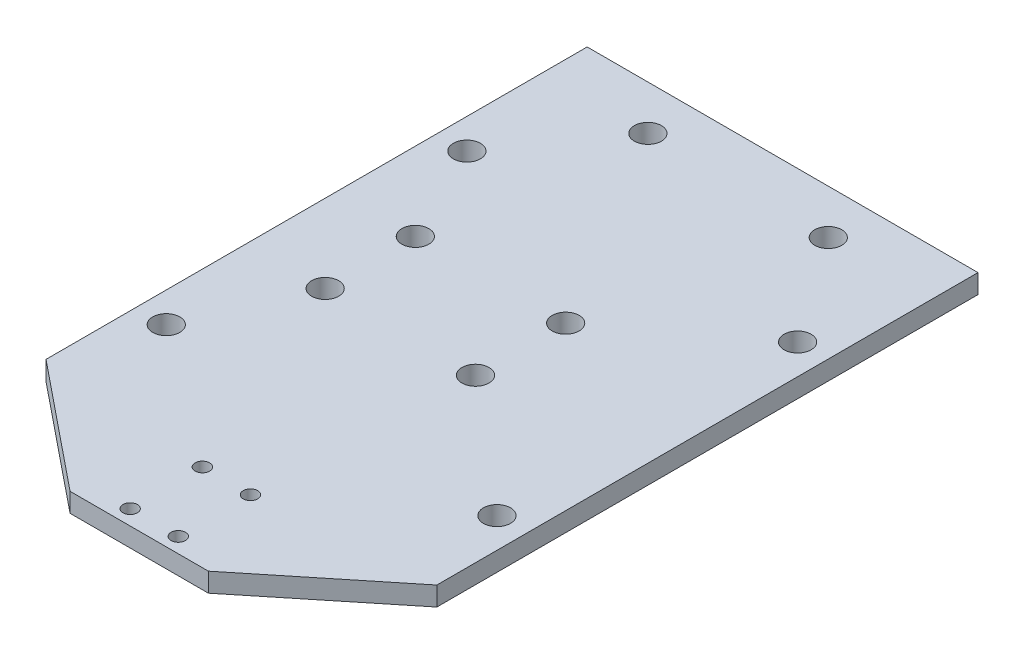
ISO-10303-21;
HEADER;
FILE_DESCRIPTION(('STEP AP214'),'2;1');
FILE_NAME('part.step','',(''),(''),'','','');
FILE_SCHEMA(('AUTOMOTIVE_DESIGN { 1 0 10303 214 1 1 1 1 }'));
ENDSEC;
DATA;
#1=APPLICATION_CONTEXT('core data for automotive mechanical design processes');
#2=APPLICATION_PROTOCOL_DEFINITION('international standard','automotive_design',2000,#1);
#3=PRODUCT_CONTEXT('',#1,'mechanical');
#4=PRODUCT('Part','Part','',(#3));
#5=PRODUCT_RELATED_PRODUCT_CATEGORY('part','',(#4));
#6=PRODUCT_DEFINITION_FORMATION('','',#4);
#7=PRODUCT_DEFINITION_CONTEXT('part definition',#1,'design');
#8=PRODUCT_DEFINITION('design','',#6,#7);
#9=PRODUCT_DEFINITION_SHAPE('','',#8);
#10=(LENGTH_UNIT() NAMED_UNIT(*) SI_UNIT(.MILLI.,.METRE.));
#11=(NAMED_UNIT(*) PLANE_ANGLE_UNIT() SI_UNIT($,.RADIAN.));
#12=(NAMED_UNIT(*) SI_UNIT($,.STERADIAN.) SOLID_ANGLE_UNIT());
#13=UNCERTAINTY_MEASURE_WITH_UNIT(LENGTH_MEASURE(1.E-05),#10,'distance_accuracy_value','');
#14=(GEOMETRIC_REPRESENTATION_CONTEXT(3) GLOBAL_UNCERTAINTY_ASSIGNED_CONTEXT((#13)) GLOBAL_UNIT_ASSIGNED_CONTEXT((#10,
#11,#12)) REPRESENTATION_CONTEXT('',''));
#15=CARTESIAN_POINT('',(0.,0.,0.));
#16=DIRECTION('',(0.,0.,1.));
#17=DIRECTION('',(1.,0.,0.));
#18=AXIS2_PLACEMENT_3D('',#15,#16,#17);
#19=CARTESIAN_POINT('',(0.,1.5875,62.));
#20=DIRECTION('',(0.,0.,-1.));
#21=DIRECTION('',(-1.,0.,0.));
#22=AXIS2_PLACEMENT_3D('',#19,#20,#21);
#23=PLANE('',#22);
#24=DIRECTION('',(1.,0.,0.));
#25=VECTOR('',#24,1.);
#26=CARTESIAN_POINT('',(0.,-1.5875,62.));
#27=LINE('',#26,#25);
#28=CARTESIAN_POINT('',(-11.5,-1.5875,62.));
#29=VERTEX_POINT('',#28);
#30=CARTESIAN_POINT('',(11.5,-1.5875,62.));
#31=VERTEX_POINT('',#30);
#32=EDGE_CURVE('E128',#29,#31,#27,.T.);
#33=ORIENTED_EDGE('',*,*,#32,.T.);
#34=DIRECTION('',(0.,-1.,0.));
#35=VECTOR('',#34,1.);
#36=CARTESIAN_POINT('',(11.5,1.5875,62.));
#37=LINE('',#36,#35);
#38=CARTESIAN_POINT('',(11.5,1.5875,62.));
#39=VERTEX_POINT('',#38);
#40=EDGE_CURVE('E11',#39,#31,#37,.T.);
#41=ORIENTED_EDGE('',*,*,#40,.F.);
#42=DIRECTION('',(1.,0.,0.));
#43=VECTOR('',#42,1.);
#44=CARTESIAN_POINT('',(0.,1.5875,62.));
#45=LINE('',#44,#43);
#46=CARTESIAN_POINT('',(-11.5,1.5875,62.));
#47=VERTEX_POINT('',#46);
#48=EDGE_CURVE('E141',#47,#39,#45,.T.);
#49=ORIENTED_EDGE('',*,*,#48,.F.);
#50=DIRECTION('',(0.,-1.,0.));
#51=VECTOR('',#50,1.);
#52=CARTESIAN_POINT('',(-11.5,1.5875,62.));
#53=LINE('',#52,#51);
#54=EDGE_CURVE('E59',#47,#29,#53,.T.);
#55=ORIENTED_EDGE('',*,*,#54,.T.);
#56=EDGE_LOOP('',(#33,#41,#49,#55));
#57=FACE_BOUND('',#56,.T.);
#58=ADVANCED_FACE('F43',(#57),#23,.F.);
#59=CARTESIAN_POINT('',(34.8732876712329,1.5875,43.0787671232877));
#60=DIRECTION('',(-0.629198228667964,0.,-0.777244870707486));
#61=DIRECTION('',(-0.777244870707486,0.,0.629198228667964));
#62=AXIS2_PLACEMENT_3D('',#59,#60,#61);
#63=PLANE('',#62);
#64=DIRECTION('',(0.777244870707486,0.,-0.629198228667964));
#65=VECTOR('',#64,1.);
#66=CARTESIAN_POINT('',(34.8732876712329,-1.5875,43.0787671232877));
#67=LINE('',#66,#65);
#68=CARTESIAN_POINT('',(32.5,-1.5875,45.));
#69=VERTEX_POINT('',#68);
#70=EDGE_CURVE('E130',#31,#69,#67,.T.);
#71=ORIENTED_EDGE('',*,*,#70,.T.);
#72=DIRECTION('',(0.,-1.,0.));
#73=VECTOR('',#72,1.);
#74=CARTESIAN_POINT('',(32.5,1.5875,45.));
#75=LINE('',#74,#73);
#76=CARTESIAN_POINT('',(32.5,1.5875,45.));
#77=VERTEX_POINT('',#76);
#78=EDGE_CURVE('E51',#77,#69,#75,.T.);
#79=ORIENTED_EDGE('',*,*,#78,.F.);
#80=DIRECTION('',(0.777244870707486,0.,-0.629198228667964));
#81=VECTOR('',#80,1.);
#82=CARTESIAN_POINT('',(34.8732876712329,1.5875,43.0787671232877));
#83=LINE('',#82,#81);
#84=EDGE_CURVE('E91',#39,#77,#83,.T.);
#85=ORIENTED_EDGE('',*,*,#84,.F.);
#86=ORIENTED_EDGE('',*,*,#40,.T.);
#87=EDGE_LOOP('',(#71,#79,#85,#86));
#88=FACE_BOUND('',#87,.T.);
#89=ADVANCED_FACE('F163',(#88),#63,.F.);
#90=CARTESIAN_POINT('',(32.5,1.5875,0.));
#91=DIRECTION('',(-1.,0.,0.));
#92=DIRECTION('',(0.,0.,1.));
#93=AXIS2_PLACEMENT_3D('',#90,#91,#92);
#94=PLANE('',#93);
#95=DIRECTION('',(0.,0.,-1.));
#96=VECTOR('',#95,1.);
#97=CARTESIAN_POINT('',(32.5,-1.5875,0.));
#98=LINE('',#97,#96);
#99=CARTESIAN_POINT('',(32.5,-1.5875,-45.));
#100=VERTEX_POINT('',#99);
#101=EDGE_CURVE('E133',#69,#100,#98,.T.);
#102=ORIENTED_EDGE('',*,*,#101,.T.);
#103=DIRECTION('',(0.,-1.,0.));
#104=VECTOR('',#103,1.);
#105=CARTESIAN_POINT('',(32.5,1.5875,-45.));
#106=LINE('',#105,#104);
#107=CARTESIAN_POINT('',(32.5,1.5875,-45.));
#108=VERTEX_POINT('',#107);
#109=EDGE_CURVE('E120',#108,#100,#106,.T.);
#110=ORIENTED_EDGE('',*,*,#109,.F.);
#111=DIRECTION('',(0.,0.,-1.));
#112=VECTOR('',#111,1.);
#113=CARTESIAN_POINT('',(32.5,1.5875,0.));
#114=LINE('',#113,#112);
#115=EDGE_CURVE('E108',#77,#108,#114,.T.);
#116=ORIENTED_EDGE('',*,*,#115,.F.);
#117=ORIENTED_EDGE('',*,*,#78,.T.);
#118=EDGE_LOOP('',(#102,#110,#116,#117));
#119=FACE_BOUND('',#118,.T.);
#120=ADVANCED_FACE('F147',(#119),#94,.F.);
#121=CARTESIAN_POINT('',(0.,1.5875,-45.));
#122=DIRECTION('',(0.,0.,1.));
#123=DIRECTION('',(1.,0.,0.));
#124=AXIS2_PLACEMENT_3D('',#121,#122,#123);
#125=PLANE('',#124);
#126=DIRECTION('',(-1.,0.,0.));
#127=VECTOR('',#126,1.);
#128=CARTESIAN_POINT('',(0.,-1.5875,-45.));
#129=LINE('',#128,#127);
#130=CARTESIAN_POINT('',(-32.5,-1.5875,-45.));
#131=VERTEX_POINT('',#130);
#132=EDGE_CURVE('E117',#100,#131,#129,.T.);
#133=ORIENTED_EDGE('',*,*,#132,.T.);
#134=DIRECTION('',(0.,-1.,0.));
#135=VECTOR('',#134,1.);
#136=CARTESIAN_POINT('',(-32.5,1.5875,-45.));
#137=LINE('',#136,#135);
#138=CARTESIAN_POINT('',(-32.5,1.5875,-45.));
#139=VERTEX_POINT('',#138);
#140=EDGE_CURVE('E114',#139,#131,#137,.T.);
#141=ORIENTED_EDGE('',*,*,#140,.F.);
#142=DIRECTION('',(-1.,0.,0.));
#143=VECTOR('',#142,1.);
#144=CARTESIAN_POINT('',(0.,1.5875,-45.));
#145=LINE('',#144,#143);
#146=EDGE_CURVE('E101',#108,#139,#145,.T.);
#147=ORIENTED_EDGE('',*,*,#146,.F.);
#148=ORIENTED_EDGE('',*,*,#109,.T.);
#149=EDGE_LOOP('',(#133,#141,#147,#148));
#150=FACE_BOUND('',#149,.T.);
#151=ADVANCED_FACE('F115',(#150),#125,.F.);
#152=CARTESIAN_POINT('',(-32.5,1.5875,0.));
#153=DIRECTION('',(-1.,0.,0.));
#154=DIRECTION('',(0.,0.,1.));
#155=AXIS2_PLACEMENT_3D('',#152,#153,#154);
#156=PLANE('',#155);
#157=DIRECTION('',(0.,0.,-1.));
#158=VECTOR('',#157,1.);
#159=CARTESIAN_POINT('',(-32.5,-1.5875,0.));
#160=LINE('',#159,#158);
#161=CARTESIAN_POINT('',(-32.5,-1.5875,45.));
#162=VERTEX_POINT('',#161);
#163=EDGE_CURVE('E136',#162,#131,#160,.T.);
#164=ORIENTED_EDGE('',*,*,#163,.F.);
#165=DIRECTION('',(0.,-1.,0.));
#166=VECTOR('',#165,1.);
#167=CARTESIAN_POINT('',(-32.5,1.5875,45.));
#168=LINE('',#167,#166);
#169=CARTESIAN_POINT('',(-32.5,1.5875,45.));
#170=VERTEX_POINT('',#169);
#171=EDGE_CURVE('E79',#170,#162,#168,.T.);
#172=ORIENTED_EDGE('',*,*,#171,.F.);
#173=DIRECTION('',(0.,0.,-1.));
#174=VECTOR('',#173,1.);
#175=CARTESIAN_POINT('',(-32.5,1.5875,0.));
#176=LINE('',#175,#174);
#177=EDGE_CURVE('E106',#170,#139,#176,.T.);
#178=ORIENTED_EDGE('',*,*,#177,.T.);
#179=ORIENTED_EDGE('',*,*,#140,.T.);
#180=EDGE_LOOP('',(#164,#172,#178,#179));
#181=FACE_BOUND('',#180,.T.);
#182=ADVANCED_FACE('F122',(#181),#156,.T.);
#183=CARTESIAN_POINT('',(-34.8732876712329,1.5875,43.0787671232876));
#184=DIRECTION('',(-0.629198228667965,0.,0.777244870707485));
#185=DIRECTION('',(0.777244870707485,0.,0.629198228667965));
#186=AXIS2_PLACEMENT_3D('',#183,#184,#185);
#187=PLANE('',#186);
#188=DIRECTION('',(-0.777244870707485,0.,-0.629198228667965));
#189=VECTOR('',#188,1.);
#190=CARTESIAN_POINT('',(-34.8732876712329,-1.5875,43.0787671232876));
#191=LINE('',#190,#189);
#192=EDGE_CURVE('E138',#29,#162,#191,.T.);
#193=ORIENTED_EDGE('',*,*,#192,.F.);
#194=ORIENTED_EDGE('',*,*,#54,.F.);
#195=DIRECTION('',(-0.777244870707485,0.,-0.629198228667965));
#196=VECTOR('',#195,1.);
#197=CARTESIAN_POINT('',(-34.8732876712329,1.5875,43.0787671232876));
#198=LINE('',#197,#196);
#199=EDGE_CURVE('E123',#47,#170,#198,.T.);
#200=ORIENTED_EDGE('',*,*,#199,.T.);
#201=ORIENTED_EDGE('',*,*,#171,.T.);
#202=EDGE_LOOP('',(#193,#194,#200,#201));
#203=FACE_BOUND('',#202,.T.);
#204=ADVANCED_FACE('F150',(#203),#187,.T.);
#205=CARTESIAN_POINT('',(0.,1.5875,0.));
#206=DIRECTION('',(0.,1.,0.));
#207=DIRECTION('',(0.,0.,1.));
#208=AXIS2_PLACEMENT_3D('',#205,#206,#207);
#209=PLANE('',#208);
#210=CARTESIAN_POINT('',(15.,1.5875,-37.6));
#211=DIRECTION('',(0.,-1.,0.));
#212=DIRECTION('',(0.,0.,-1.));
#213=AXIS2_PLACEMENT_3D('',#210,#211,#212);
#214=CIRCLE('',#213,2.25);
#215=CARTESIAN_POINT('',(15.,1.5875,-39.85));
#216=VERTEX_POINT('',#215);
#217=EDGE_CURVE('E248',#216,#216,#214,.T.);
#218=ORIENTED_EDGE('',*,*,#217,.T.);
#219=EDGE_LOOP('',(#218));
#220=FACE_BOUND('',#219,.T.);
#221=CARTESIAN_POINT('',(-15.,1.5875,-37.6));
#222=DIRECTION('',(0.,-1.,0.));
#223=DIRECTION('',(0.,0.,-1.));
#224=AXIS2_PLACEMENT_3D('',#221,#222,#223);
#225=CIRCLE('',#224,2.25);
#226=CARTESIAN_POINT('',(-15.,1.5875,-39.85));
#227=VERTEX_POINT('',#226);
#228=EDGE_CURVE('E242',#227,#227,#225,.T.);
#229=ORIENTED_EDGE('',*,*,#228,.T.);
#230=EDGE_LOOP('',(#229));
#231=FACE_BOUND('',#230,.T.);
#232=CARTESIAN_POINT('',(-19.5,1.5875,11.575));
#233=DIRECTION('',(0.,1.,0.));
#234=DIRECTION('',(0.,0.,1.));
#235=AXIS2_PLACEMENT_3D('',#232,#233,#234);
#236=CIRCLE('',#235,2.24999999999999);
#237=CARTESIAN_POINT('',(-19.5,1.5875,13.825));
#238=VERTEX_POINT('',#237);
#239=EDGE_CURVE('E239',#238,#238,#236,.T.);
#240=ORIENTED_EDGE('',*,*,#239,.F.);
#241=EDGE_LOOP('',(#240));
#242=FACE_BOUND('',#241,.T.);
#243=CARTESIAN_POINT('',(-19.5,1.5875,-3.42499999999997));
#244=DIRECTION('',(0.,1.,0.));
#245=DIRECTION('',(0.,0.,1.));
#246=AXIS2_PLACEMENT_3D('',#243,#244,#245);
#247=CIRCLE('',#246,2.24999999999999);
#248=CARTESIAN_POINT('',(-19.5,1.5875,-1.17499999999998));
#249=VERTEX_POINT('',#248);
#250=EDGE_CURVE('E233',#249,#249,#247,.T.);
#251=ORIENTED_EDGE('',*,*,#250,.F.);
#252=EDGE_LOOP('',(#251));
#253=FACE_BOUND('',#252,.T.);
#254=CARTESIAN_POINT('',(5.5,1.5875,-3.42499999999997));
#255=DIRECTION('',(0.,1.,0.));
#256=DIRECTION('',(0.,0.,1.));
#257=AXIS2_PLACEMENT_3D('',#254,#255,#256);
#258=CIRCLE('',#257,2.24999999999999);
#259=CARTESIAN_POINT('',(5.5,1.5875,-1.17499999999998));
#260=VERTEX_POINT('',#259);
#261=EDGE_CURVE('E227',#260,#260,#258,.T.);
#262=ORIENTED_EDGE('',*,*,#261,.F.);
#263=EDGE_LOOP('',(#262));
#264=FACE_BOUND('',#263,.T.);
#265=CARTESIAN_POINT('',(5.5,1.5875,11.575));
#266=DIRECTION('',(0.,1.,0.));
#267=DIRECTION('',(0.,0.,1.));
#268=AXIS2_PLACEMENT_3D('',#265,#266,#267);
#269=CIRCLE('',#268,2.24999999999999);
#270=CARTESIAN_POINT('',(5.5,1.5875,13.825));
#271=VERTEX_POINT('',#270);
#272=EDGE_CURVE('E221',#271,#271,#269,.T.);
#273=ORIENTED_EDGE('',*,*,#272,.F.);
#274=EDGE_LOOP('',(#273));
#275=FACE_BOUND('',#274,.T.);
#276=CARTESIAN_POINT('',(-27.5,1.5875,-20.));
#277=DIRECTION('',(0.,1.,0.));
#278=DIRECTION('',(0.,0.,1.));
#279=AXIS2_PLACEMENT_3D('',#276,#277,#278);
#280=CIRCLE('',#279,2.24999999999999);
#281=CARTESIAN_POINT('',(-27.5,1.5875,-17.75));
#282=VERTEX_POINT('',#281);
#283=EDGE_CURVE('E215',#282,#282,#280,.T.);
#284=ORIENTED_EDGE('',*,*,#283,.F.);
#285=EDGE_LOOP('',(#284));
#286=FACE_BOUND('',#285,.T.);
#287=CARTESIAN_POINT('',(27.5,1.5875,-20.));
#288=DIRECTION('',(0.,1.,0.));
#289=DIRECTION('',(0.,0.,1.));
#290=AXIS2_PLACEMENT_3D('',#287,#288,#289);
#291=CIRCLE('',#290,2.24999999999999);
#292=CARTESIAN_POINT('',(27.5,1.5875,-17.75));
#293=VERTEX_POINT('',#292);
#294=EDGE_CURVE('E209',#293,#293,#291,.T.);
#295=ORIENTED_EDGE('',*,*,#294,.F.);
#296=EDGE_LOOP('',(#295));
#297=FACE_BOUND('',#296,.T.);
#298=CARTESIAN_POINT('',(27.5,1.5875,30.));
#299=DIRECTION('',(0.,1.,0.));
#300=DIRECTION('',(0.,0.,1.));
#301=AXIS2_PLACEMENT_3D('',#298,#299,#300);
#302=CIRCLE('',#301,2.24999999999999);
#303=CARTESIAN_POINT('',(27.5,1.5875,32.25));
#304=VERTEX_POINT('',#303);
#305=EDGE_CURVE('E203',#304,#304,#302,.T.);
#306=ORIENTED_EDGE('',*,*,#305,.F.);
#307=EDGE_LOOP('',(#306));
#308=FACE_BOUND('',#307,.T.);
#309=CARTESIAN_POINT('',(-27.5,1.5875,30.));
#310=DIRECTION('',(0.,1.,0.));
#311=DIRECTION('',(0.,0.,1.));
#312=AXIS2_PLACEMENT_3D('',#309,#310,#311);
#313=CIRCLE('',#312,2.24999999999999);
#314=CARTESIAN_POINT('',(-27.5,1.5875,32.25));
#315=VERTEX_POINT('',#314);
#316=EDGE_CURVE('E197',#315,#315,#313,.T.);
#317=ORIENTED_EDGE('',*,*,#316,.F.);
#318=EDGE_LOOP('',(#317));
#319=FACE_BOUND('',#318,.T.);
#320=CARTESIAN_POINT('',(-4.,1.5875,59.5));
#321=DIRECTION('',(0.,1.,0.));
#322=DIRECTION('',(0.,0.,1.));
#323=AXIS2_PLACEMENT_3D('',#320,#321,#322);
#324=CIRCLE('',#323,1.2);
#325=CARTESIAN_POINT('',(-4.,1.5875,60.7));
#326=VERTEX_POINT('',#325);
#327=EDGE_CURVE('E191',#326,#326,#324,.T.);
#328=ORIENTED_EDGE('',*,*,#327,.F.);
#329=EDGE_LOOP('',(#328));
#330=FACE_BOUND('',#329,.T.);
#331=CARTESIAN_POINT('',(4.,1.5875,59.5));
#332=DIRECTION('',(0.,1.,0.));
#333=DIRECTION('',(0.,0.,1.));
#334=AXIS2_PLACEMENT_3D('',#331,#332,#333);
#335=CIRCLE('',#334,1.2);
#336=CARTESIAN_POINT('',(4.,1.5875,60.7));
#337=VERTEX_POINT('',#336);
#338=EDGE_CURVE('E185',#337,#337,#335,.T.);
#339=ORIENTED_EDGE('',*,*,#338,.F.);
#340=EDGE_LOOP('',(#339));
#341=FACE_BOUND('',#340,.T.);
#342=CARTESIAN_POINT('',(4.,1.5875,47.5));
#343=DIRECTION('',(0.,1.,0.));
#344=DIRECTION('',(0.,0.,1.));
#345=AXIS2_PLACEMENT_3D('',#342,#343,#344);
#346=CIRCLE('',#345,1.2);
#347=CARTESIAN_POINT('',(4.,1.5875,48.7));
#348=VERTEX_POINT('',#347);
#349=EDGE_CURVE('E179',#348,#348,#346,.T.);
#350=ORIENTED_EDGE('',*,*,#349,.F.);
#351=EDGE_LOOP('',(#350));
#352=FACE_BOUND('',#351,.T.);
#353=CARTESIAN_POINT('',(-4.,1.5875,47.5));
#354=DIRECTION('',(0.,1.,0.));
#355=DIRECTION('',(0.,0.,1.));
#356=AXIS2_PLACEMENT_3D('',#353,#354,#355);
#357=CIRCLE('',#356,1.2);
#358=CARTESIAN_POINT('',(-4.,1.5875,48.7));
#359=VERTEX_POINT('',#358);
#360=EDGE_CURVE('E173',#359,#359,#357,.T.);
#361=ORIENTED_EDGE('',*,*,#360,.F.);
#362=EDGE_LOOP('',(#361));
#363=FACE_BOUND('',#362,.T.);
#364=ORIENTED_EDGE('',*,*,#48,.T.);
#365=ORIENTED_EDGE('',*,*,#84,.T.);
#366=ORIENTED_EDGE('',*,*,#115,.T.);
#367=ORIENTED_EDGE('',*,*,#146,.T.);
#368=ORIENTED_EDGE('',*,*,#177,.F.);
#369=ORIENTED_EDGE('',*,*,#199,.F.);
#370=EDGE_LOOP('',(#364,#365,#366,#367,#368,#369));
#371=FACE_BOUND('',#370,.T.);
#372=ADVANCED_FACE('F103',(#220,#231,#242,#253,#264,#275,#286,#297,#308,#319,#330,#341,#352,
#363,#371),#209,.T.);
#373=CARTESIAN_POINT('',(0.,-1.5875,0.));
#374=DIRECTION('',(0.,1.,0.));
#375=DIRECTION('',(0.,0.,1.));
#376=AXIS2_PLACEMENT_3D('',#373,#374,#375);
#377=PLANE('',#376);
#378=CARTESIAN_POINT('',(15.,-1.5875,-37.6));
#379=DIRECTION('',(0.,-1.,0.));
#380=DIRECTION('',(0.,0.,-1.));
#381=AXIS2_PLACEMENT_3D('',#378,#379,#380);
#382=CIRCLE('',#381,2.24999999999999);
#383=CARTESIAN_POINT('',(15.,-1.5875,-39.85));
#384=VERTEX_POINT('',#383);
#385=EDGE_CURVE('E251',#384,#384,#382,.T.);
#386=ORIENTED_EDGE('',*,*,#385,.F.);
#387=EDGE_LOOP('',(#386));
#388=FACE_BOUND('',#387,.T.);
#389=CARTESIAN_POINT('',(-15.,-1.5875,-37.6));
#390=DIRECTION('',(0.,-1.,0.));
#391=DIRECTION('',(0.,0.,-1.));
#392=AXIS2_PLACEMENT_3D('',#389,#390,#391);
#393=CIRCLE('',#392,2.24999999999999);
#394=CARTESIAN_POINT('',(-15.,-1.5875,-39.85));
#395=VERTEX_POINT('',#394);
#396=EDGE_CURVE('E245',#395,#395,#393,.T.);
#397=ORIENTED_EDGE('',*,*,#396,.F.);
#398=EDGE_LOOP('',(#397));
#399=FACE_BOUND('',#398,.T.);
#400=CARTESIAN_POINT('',(-19.5,-1.5875,11.575));
#401=DIRECTION('',(0.,1.,0.));
#402=DIRECTION('',(0.,0.,1.));
#403=AXIS2_PLACEMENT_3D('',#400,#401,#402);
#404=CIRCLE('',#403,2.24999999999999);
#405=CARTESIAN_POINT('',(-19.5,-1.5875,13.825));
#406=VERTEX_POINT('',#405);
#407=EDGE_CURVE('E236',#406,#406,#404,.T.);
#408=ORIENTED_EDGE('',*,*,#407,.T.);
#409=EDGE_LOOP('',(#408));
#410=FACE_BOUND('',#409,.T.);
#411=CARTESIAN_POINT('',(-19.5,-1.5875,-3.42499999999997));
#412=DIRECTION('',(0.,1.,0.));
#413=DIRECTION('',(0.,0.,1.));
#414=AXIS2_PLACEMENT_3D('',#411,#412,#413);
#415=CIRCLE('',#414,2.24999999999999);
#416=CARTESIAN_POINT('',(-19.5,-1.5875,-1.17499999999998));
#417=VERTEX_POINT('',#416);
#418=EDGE_CURVE('E230',#417,#417,#415,.T.);
#419=ORIENTED_EDGE('',*,*,#418,.T.);
#420=EDGE_LOOP('',(#419));
#421=FACE_BOUND('',#420,.T.);
#422=CARTESIAN_POINT('',(5.5,-1.5875,-3.42499999999997));
#423=DIRECTION('',(0.,1.,0.));
#424=DIRECTION('',(0.,0.,1.));
#425=AXIS2_PLACEMENT_3D('',#422,#423,#424);
#426=CIRCLE('',#425,2.24999999999999);
#427=CARTESIAN_POINT('',(5.5,-1.5875,-1.17499999999998));
#428=VERTEX_POINT('',#427);
#429=EDGE_CURVE('E224',#428,#428,#426,.T.);
#430=ORIENTED_EDGE('',*,*,#429,.T.);
#431=EDGE_LOOP('',(#430));
#432=FACE_BOUND('',#431,.T.);
#433=CARTESIAN_POINT('',(5.5,-1.5875,11.575));
#434=DIRECTION('',(0.,1.,0.));
#435=DIRECTION('',(0.,0.,1.));
#436=AXIS2_PLACEMENT_3D('',#433,#434,#435);
#437=CIRCLE('',#436,2.24999999999999);
#438=CARTESIAN_POINT('',(5.5,-1.5875,13.825));
#439=VERTEX_POINT('',#438);
#440=EDGE_CURVE('E218',#439,#439,#437,.T.);
#441=ORIENTED_EDGE('',*,*,#440,.T.);
#442=EDGE_LOOP('',(#441));
#443=FACE_BOUND('',#442,.T.);
#444=CARTESIAN_POINT('',(-27.5,-1.5875,-20.));
#445=DIRECTION('',(0.,1.,0.));
#446=DIRECTION('',(0.,0.,1.));
#447=AXIS2_PLACEMENT_3D('',#444,#445,#446);
#448=CIRCLE('',#447,2.25);
#449=CARTESIAN_POINT('',(-27.5,-1.5875,-17.75));
#450=VERTEX_POINT('',#449);
#451=EDGE_CURVE('E212',#450,#450,#448,.T.);
#452=ORIENTED_EDGE('',*,*,#451,.T.);
#453=EDGE_LOOP('',(#452));
#454=FACE_BOUND('',#453,.T.);
#455=CARTESIAN_POINT('',(27.5,-1.5875,-20.));
#456=DIRECTION('',(0.,1.,0.));
#457=DIRECTION('',(0.,0.,1.));
#458=AXIS2_PLACEMENT_3D('',#455,#456,#457);
#459=CIRCLE('',#458,2.25);
#460=CARTESIAN_POINT('',(27.5,-1.5875,-17.75));
#461=VERTEX_POINT('',#460);
#462=EDGE_CURVE('E206',#461,#461,#459,.T.);
#463=ORIENTED_EDGE('',*,*,#462,.T.);
#464=EDGE_LOOP('',(#463));
#465=FACE_BOUND('',#464,.T.);
#466=CARTESIAN_POINT('',(27.5,-1.5875,30.));
#467=DIRECTION('',(0.,1.,0.));
#468=DIRECTION('',(0.,0.,1.));
#469=AXIS2_PLACEMENT_3D('',#466,#467,#468);
#470=CIRCLE('',#469,2.25);
#471=CARTESIAN_POINT('',(27.5,-1.5875,32.25));
#472=VERTEX_POINT('',#471);
#473=EDGE_CURVE('E200',#472,#472,#470,.T.);
#474=ORIENTED_EDGE('',*,*,#473,.T.);
#475=EDGE_LOOP('',(#474));
#476=FACE_BOUND('',#475,.T.);
#477=CARTESIAN_POINT('',(-27.5,-1.5875,30.));
#478=DIRECTION('',(0.,1.,0.));
#479=DIRECTION('',(0.,0.,1.));
#480=AXIS2_PLACEMENT_3D('',#477,#478,#479);
#481=CIRCLE('',#480,2.25);
#482=CARTESIAN_POINT('',(-27.5,-1.5875,32.25));
#483=VERTEX_POINT('',#482);
#484=EDGE_CURVE('E194',#483,#483,#481,.T.);
#485=ORIENTED_EDGE('',*,*,#484,.T.);
#486=EDGE_LOOP('',(#485));
#487=FACE_BOUND('',#486,.T.);
#488=CARTESIAN_POINT('',(-4.,-1.5875,59.5));
#489=DIRECTION('',(0.,1.,0.));
#490=DIRECTION('',(0.,0.,1.));
#491=AXIS2_PLACEMENT_3D('',#488,#489,#490);
#492=CIRCLE('',#491,1.19999999999999);
#493=CARTESIAN_POINT('',(-4.,-1.5875,60.7));
#494=VERTEX_POINT('',#493);
#495=EDGE_CURVE('E188',#494,#494,#492,.T.);
#496=ORIENTED_EDGE('',*,*,#495,.T.);
#497=EDGE_LOOP('',(#496));
#498=FACE_BOUND('',#497,.T.);
#499=CARTESIAN_POINT('',(4.,-1.5875,59.5));
#500=DIRECTION('',(0.,1.,0.));
#501=DIRECTION('',(0.,0.,1.));
#502=AXIS2_PLACEMENT_3D('',#499,#500,#501);
#503=CIRCLE('',#502,1.19999999999999);
#504=CARTESIAN_POINT('',(4.,-1.5875,60.7));
#505=VERTEX_POINT('',#504);
#506=EDGE_CURVE('E182',#505,#505,#503,.T.);
#507=ORIENTED_EDGE('',*,*,#506,.T.);
#508=EDGE_LOOP('',(#507));
#509=FACE_BOUND('',#508,.T.);
#510=CARTESIAN_POINT('',(4.,-1.5875,47.5));
#511=DIRECTION('',(0.,1.,0.));
#512=DIRECTION('',(0.,0.,1.));
#513=AXIS2_PLACEMENT_3D('',#510,#511,#512);
#514=CIRCLE('',#513,1.19999999999999);
#515=CARTESIAN_POINT('',(4.,-1.5875,48.7));
#516=VERTEX_POINT('',#515);
#517=EDGE_CURVE('E176',#516,#516,#514,.T.);
#518=ORIENTED_EDGE('',*,*,#517,.T.);
#519=EDGE_LOOP('',(#518));
#520=FACE_BOUND('',#519,.T.);
#521=CARTESIAN_POINT('',(-4.,-1.5875,47.5));
#522=DIRECTION('',(0.,1.,0.));
#523=DIRECTION('',(0.,0.,1.));
#524=AXIS2_PLACEMENT_3D('',#521,#522,#523);
#525=CIRCLE('',#524,1.19999999999999);
#526=CARTESIAN_POINT('',(-4.,-1.5875,48.7));
#527=VERTEX_POINT('',#526);
#528=EDGE_CURVE('E131',#527,#527,#525,.T.);
#529=ORIENTED_EDGE('',*,*,#528,.T.);
#530=EDGE_LOOP('',(#529));
#531=FACE_BOUND('',#530,.T.);
#532=ORIENTED_EDGE('',*,*,#32,.F.);
#533=ORIENTED_EDGE('',*,*,#192,.T.);
#534=ORIENTED_EDGE('',*,*,#163,.T.);
#535=ORIENTED_EDGE('',*,*,#132,.F.);
#536=ORIENTED_EDGE('',*,*,#101,.F.);
#537=ORIENTED_EDGE('',*,*,#70,.F.);
#538=EDGE_LOOP('',(#532,#533,#534,#535,#536,#537));
#539=FACE_BOUND('',#538,.T.);
#540=ADVANCED_FACE('F149',(#388,#399,#410,#421,#432,#443,#454,#465,#476,#487,#498,#509,#520,
#531,#539),#377,.F.);
#541=CARTESIAN_POINT('',(-4.,1.5875,47.5));
#542=DIRECTION('',(0.,1.,0.));
#543=DIRECTION('',(0.,0.,1.));
#544=AXIS2_PLACEMENT_3D('',#541,#542,#543);
#545=CYLINDRICAL_SURFACE('',#544,1.19999999999999);
#546=ORIENTED_EDGE('',*,*,#528,.F.);
#547=EDGE_LOOP('',(#546));
#548=FACE_BOUND('',#547,.T.);
#549=ORIENTED_EDGE('',*,*,#360,.T.);
#550=EDGE_LOOP('',(#549));
#551=FACE_BOUND('',#550,.T.);
#552=ADVANCED_FACE('F259',(#548,#551),#545,.F.);
#553=CARTESIAN_POINT('',(4.,1.5875,47.5));
#554=DIRECTION('',(0.,1.,0.));
#555=DIRECTION('',(0.,0.,1.));
#556=AXIS2_PLACEMENT_3D('',#553,#554,#555);
#557=CYLINDRICAL_SURFACE('',#556,1.19999999999999);
#558=ORIENTED_EDGE('',*,*,#517,.F.);
#559=EDGE_LOOP('',(#558));
#560=FACE_BOUND('',#559,.T.);
#561=ORIENTED_EDGE('',*,*,#349,.T.);
#562=EDGE_LOOP('',(#561));
#563=FACE_BOUND('',#562,.T.);
#564=ADVANCED_FACE('F287',(#560,#563),#557,.F.);
#565=CARTESIAN_POINT('',(4.,1.5875,59.5));
#566=DIRECTION('',(0.,1.,0.));
#567=DIRECTION('',(0.,0.,1.));
#568=AXIS2_PLACEMENT_3D('',#565,#566,#567);
#569=CYLINDRICAL_SURFACE('',#568,1.19999999999999);
#570=ORIENTED_EDGE('',*,*,#506,.F.);
#571=EDGE_LOOP('',(#570));
#572=FACE_BOUND('',#571,.T.);
#573=ORIENTED_EDGE('',*,*,#338,.T.);
#574=EDGE_LOOP('',(#573));
#575=FACE_BOUND('',#574,.T.);
#576=ADVANCED_FACE('F294',(#572,#575),#569,.F.);
#577=CARTESIAN_POINT('',(-4.,1.5875,59.5));
#578=DIRECTION('',(0.,1.,0.));
#579=DIRECTION('',(0.,0.,1.));
#580=AXIS2_PLACEMENT_3D('',#577,#578,#579);
#581=CYLINDRICAL_SURFACE('',#580,1.19999999999999);
#582=ORIENTED_EDGE('',*,*,#495,.F.);
#583=EDGE_LOOP('',(#582));
#584=FACE_BOUND('',#583,.T.);
#585=ORIENTED_EDGE('',*,*,#327,.T.);
#586=EDGE_LOOP('',(#585));
#587=FACE_BOUND('',#586,.T.);
#588=ADVANCED_FACE('F300',(#584,#587),#581,.F.);
#589=CARTESIAN_POINT('',(-27.5,1.5875,30.));
#590=DIRECTION('',(0.,1.,0.));
#591=DIRECTION('',(0.,0.,1.));
#592=AXIS2_PLACEMENT_3D('',#589,#590,#591);
#593=CYLINDRICAL_SURFACE('',#592,2.24999999999999);
#594=ORIENTED_EDGE('',*,*,#484,.F.);
#595=EDGE_LOOP('',(#594));
#596=FACE_BOUND('',#595,.T.);
#597=ORIENTED_EDGE('',*,*,#316,.T.);
#598=EDGE_LOOP('',(#597));
#599=FACE_BOUND('',#598,.T.);
#600=ADVANCED_FACE('F304',(#596,#599),#593,.F.);
#601=CARTESIAN_POINT('',(27.5,1.5875,30.));
#602=DIRECTION('',(0.,1.,0.));
#603=DIRECTION('',(0.,0.,1.));
#604=AXIS2_PLACEMENT_3D('',#601,#602,#603);
#605=CYLINDRICAL_SURFACE('',#604,2.24999999999999);
#606=ORIENTED_EDGE('',*,*,#473,.F.);
#607=EDGE_LOOP('',(#606));
#608=FACE_BOUND('',#607,.T.);
#609=ORIENTED_EDGE('',*,*,#305,.T.);
#610=EDGE_LOOP('',(#609));
#611=FACE_BOUND('',#610,.T.);
#612=ADVANCED_FACE('F308',(#608,#611),#605,.F.);
#613=CARTESIAN_POINT('',(27.5,1.5875,-20.));
#614=DIRECTION('',(0.,1.,0.));
#615=DIRECTION('',(0.,0.,1.));
#616=AXIS2_PLACEMENT_3D('',#613,#614,#615);
#617=CYLINDRICAL_SURFACE('',#616,2.24999999999999);
#618=ORIENTED_EDGE('',*,*,#462,.F.);
#619=EDGE_LOOP('',(#618));
#620=FACE_BOUND('',#619,.T.);
#621=ORIENTED_EDGE('',*,*,#294,.T.);
#622=EDGE_LOOP('',(#621));
#623=FACE_BOUND('',#622,.T.);
#624=ADVANCED_FACE('F312',(#620,#623),#617,.F.);
#625=CARTESIAN_POINT('',(-27.5,1.5875,-20.));
#626=DIRECTION('',(0.,1.,0.));
#627=DIRECTION('',(0.,0.,1.));
#628=AXIS2_PLACEMENT_3D('',#625,#626,#627);
#629=CYLINDRICAL_SURFACE('',#628,2.24999999999999);
#630=ORIENTED_EDGE('',*,*,#451,.F.);
#631=EDGE_LOOP('',(#630));
#632=FACE_BOUND('',#631,.T.);
#633=ORIENTED_EDGE('',*,*,#283,.T.);
#634=EDGE_LOOP('',(#633));
#635=FACE_BOUND('',#634,.T.);
#636=ADVANCED_FACE('F316',(#632,#635),#629,.F.);
#637=CARTESIAN_POINT('',(5.5,1.5875,11.575));
#638=DIRECTION('',(0.,1.,0.));
#639=DIRECTION('',(0.,0.,1.));
#640=AXIS2_PLACEMENT_3D('',#637,#638,#639);
#641=CYLINDRICAL_SURFACE('',#640,2.24999999999999);
#642=ORIENTED_EDGE('',*,*,#440,.F.);
#643=EDGE_LOOP('',(#642));
#644=FACE_BOUND('',#643,.T.);
#645=ORIENTED_EDGE('',*,*,#272,.T.);
#646=EDGE_LOOP('',(#645));
#647=FACE_BOUND('',#646,.T.);
#648=ADVANCED_FACE('F320',(#644,#647),#641,.F.);
#649=CARTESIAN_POINT('',(5.5,1.5875,-3.42499999999997));
#650=DIRECTION('',(0.,1.,0.));
#651=DIRECTION('',(0.,0.,1.));
#652=AXIS2_PLACEMENT_3D('',#649,#650,#651);
#653=CYLINDRICAL_SURFACE('',#652,2.24999999999999);
#654=ORIENTED_EDGE('',*,*,#429,.F.);
#655=EDGE_LOOP('',(#654));
#656=FACE_BOUND('',#655,.T.);
#657=ORIENTED_EDGE('',*,*,#261,.T.);
#658=EDGE_LOOP('',(#657));
#659=FACE_BOUND('',#658,.T.);
#660=ADVANCED_FACE('F324',(#656,#659),#653,.F.);
#661=CARTESIAN_POINT('',(-19.5,1.5875,-3.42499999999997));
#662=DIRECTION('',(0.,1.,0.));
#663=DIRECTION('',(0.,0.,1.));
#664=AXIS2_PLACEMENT_3D('',#661,#662,#663);
#665=CYLINDRICAL_SURFACE('',#664,2.24999999999999);
#666=ORIENTED_EDGE('',*,*,#418,.F.);
#667=EDGE_LOOP('',(#666));
#668=FACE_BOUND('',#667,.T.);
#669=ORIENTED_EDGE('',*,*,#250,.T.);
#670=EDGE_LOOP('',(#669));
#671=FACE_BOUND('',#670,.T.);
#672=ADVANCED_FACE('F328',(#668,#671),#665,.F.);
#673=CARTESIAN_POINT('',(-19.5,1.5875,11.575));
#674=DIRECTION('',(0.,1.,0.));
#675=DIRECTION('',(0.,0.,1.));
#676=AXIS2_PLACEMENT_3D('',#673,#674,#675);
#677=CYLINDRICAL_SURFACE('',#676,2.24999999999999);
#678=ORIENTED_EDGE('',*,*,#407,.F.);
#679=EDGE_LOOP('',(#678));
#680=FACE_BOUND('',#679,.T.);
#681=ORIENTED_EDGE('',*,*,#239,.T.);
#682=EDGE_LOOP('',(#681));
#683=FACE_BOUND('',#682,.T.);
#684=ADVANCED_FACE('F332',(#680,#683),#677,.F.);
#685=CARTESIAN_POINT('',(-15.,-1.5875,-37.6));
#686=DIRECTION('',(0.,-1.,0.));
#687=DIRECTION('',(0.,0.,-1.));
#688=AXIS2_PLACEMENT_3D('',#685,#686,#687);
#689=CYLINDRICAL_SURFACE('',#688,2.24999999999999);
#690=ORIENTED_EDGE('',*,*,#228,.F.);
#691=EDGE_LOOP('',(#690));
#692=FACE_BOUND('',#691,.T.);
#693=ORIENTED_EDGE('',*,*,#396,.T.);
#694=EDGE_LOOP('',(#693));
#695=FACE_BOUND('',#694,.T.);
#696=ADVANCED_FACE('F336',(#692,#695),#689,.F.);
#697=CARTESIAN_POINT('',(15.,-1.5875,-37.6));
#698=DIRECTION('',(0.,-1.,0.));
#699=DIRECTION('',(0.,0.,-1.));
#700=AXIS2_PLACEMENT_3D('',#697,#698,#699);
#701=CYLINDRICAL_SURFACE('',#700,2.24999999999999);
#702=ORIENTED_EDGE('',*,*,#217,.F.);
#703=EDGE_LOOP('',(#702));
#704=FACE_BOUND('',#703,.T.);
#705=ORIENTED_EDGE('',*,*,#385,.T.);
#706=EDGE_LOOP('',(#705));
#707=FACE_BOUND('',#706,.T.);
#708=ADVANCED_FACE('F255',(#704,#707),#701,.F.);
#709=CLOSED_SHELL('',(#58,#89,#120,#151,#182,#204,#372,#540,#552,#564,#576,#588,#600,#612,#624,
#636,#648,#660,#672,#684,#696,#708));
#710=MANIFOLD_SOLID_BREP('B2',#709);
#711=ADVANCED_BREP_SHAPE_REPRESENTATION('',(#18,#710),#14);
#712=SHAPE_DEFINITION_REPRESENTATION(#9,#711);
ENDSEC;
END-ISO-10303-21;
